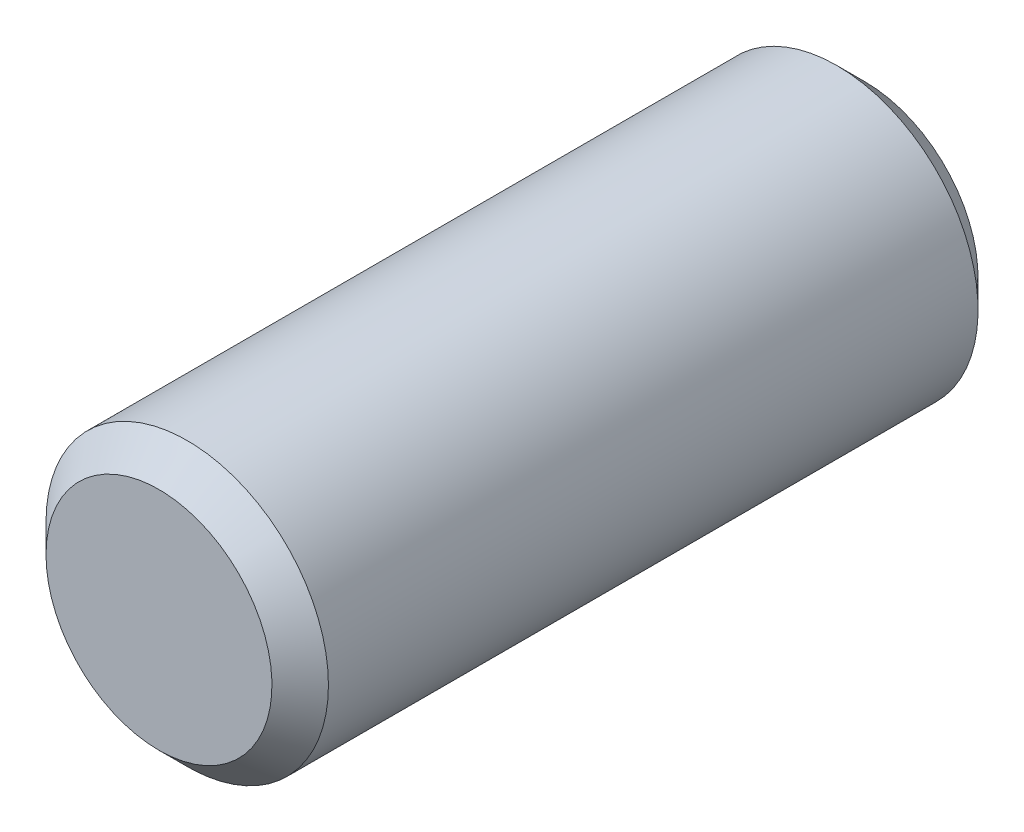
ISO-10303-21;
HEADER;
FILE_DESCRIPTION(('STEP AP214'),'2;1');
FILE_NAME('part.step','',(''),(''),'','','');
FILE_SCHEMA(('AUTOMOTIVE_DESIGN { 1 0 10303 214 1 1 1 1 }'));
ENDSEC;
DATA;
#1=APPLICATION_CONTEXT('core data for automotive mechanical design processes');
#2=APPLICATION_PROTOCOL_DEFINITION('international standard','automotive_design',2000,#1);
#3=PRODUCT_CONTEXT('',#1,'mechanical');
#4=PRODUCT('Part','Part','',(#3));
#5=PRODUCT_RELATED_PRODUCT_CATEGORY('part','',(#4));
#6=PRODUCT_DEFINITION_FORMATION('','',#4);
#7=PRODUCT_DEFINITION_CONTEXT('part definition',#1,'design');
#8=PRODUCT_DEFINITION('design','',#6,#7);
#9=PRODUCT_DEFINITION_SHAPE('','',#8);
#10=(LENGTH_UNIT() NAMED_UNIT(*) SI_UNIT(.MILLI.,.METRE.));
#11=(NAMED_UNIT(*) PLANE_ANGLE_UNIT() SI_UNIT($,.RADIAN.));
#12=(NAMED_UNIT(*) SI_UNIT($,.STERADIAN.) SOLID_ANGLE_UNIT());
#13=UNCERTAINTY_MEASURE_WITH_UNIT(LENGTH_MEASURE(1.E-05),#10,'distance_accuracy_value','');
#14=(GEOMETRIC_REPRESENTATION_CONTEXT(3) GLOBAL_UNCERTAINTY_ASSIGNED_CONTEXT((#13)) GLOBAL_UNIT_ASSIGNED_CONTEXT((#10,
#11,#12)) REPRESENTATION_CONTEXT('',''));
#15=CARTESIAN_POINT('',(0.,0.,0.));
#16=DIRECTION('',(0.,0.,1.));
#17=DIRECTION('',(1.,0.,0.));
#18=AXIS2_PLACEMENT_3D('',#15,#16,#17);
#19=CARTESIAN_POINT('',(0.,0.249999999999996,1.24999999999999));
#20=DIRECTION('',(0.,0.,1.));
#21=DIRECTION('',(0.,-1.,0.));
#22=AXIS2_PLACEMENT_3D('',#19,#20,#21);
#23=PLANE('',#22);
#24=CARTESIAN_POINT('',(0.,-0.250000000000004,1.24999999999999));
#25=DIRECTION('',(0.,0.,1.));
#26=DIRECTION('',(0.,-1.,0.));
#27=AXIS2_PLACEMENT_3D('',#24,#25,#26);
#28=CIRCLE('',#27,0.399999999999999);
#29=CARTESIAN_POINT('',(0.,-0.650000000000003,1.24999999999999));
#30=VERTEX_POINT('',#29);
#31=EDGE_CURVE('E10',#30,#30,#28,.T.);
#32=ORIENTED_EDGE('',*,*,#31,.T.);
#33=EDGE_LOOP('',(#32));
#34=FACE_BOUND('',#33,.T.);
#35=ADVANCED_FACE('F30',(#34),#23,.T.);
#36=CARTESIAN_POINT('',(0.,-0.250000000000003,-1.25000000000002));
#37=DIRECTION('',(0.,0.,-1.));
#38=DIRECTION('',(0.,1.,0.));
#39=AXIS2_PLACEMENT_3D('',#36,#37,#38);
#40=CYLINDRICAL_SURFACE('',#39,0.5);
#41=CARTESIAN_POINT('',(0.,-0.250000000000003,-1.15000000000002));
#42=DIRECTION('',(0.,0.,-1.));
#43=DIRECTION('',(-1.,0.,0.));
#44=AXIS2_PLACEMENT_3D('',#41,#42,#43);
#45=CIRCLE('',#44,0.5);
#46=CARTESIAN_POINT('',(-0.5,-0.250000000000003,-1.15000000000002));
#47=VERTEX_POINT('',#46);
#48=EDGE_CURVE('E37',#47,#47,#45,.F.);
#49=ORIENTED_EDGE('',*,*,#48,.T.);
#50=EDGE_LOOP('',(#49));
#51=FACE_BOUND('',#50,.T.);
#52=CARTESIAN_POINT('',(0.,-0.250000000000004,1.14999999999999));
#53=DIRECTION('',(0.,0.,1.));
#54=DIRECTION('',(1.,0.,0.));
#55=AXIS2_PLACEMENT_3D('',#52,#53,#54);
#56=CIRCLE('',#55,0.5);
#57=CARTESIAN_POINT('',(0.5,-0.250000000000004,1.14999999999999));
#58=VERTEX_POINT('',#57);
#59=EDGE_CURVE('E41',#58,#58,#56,.F.);
#60=ORIENTED_EDGE('',*,*,#59,.T.);
#61=EDGE_LOOP('',(#60));
#62=FACE_BOUND('',#61,.T.);
#63=ADVANCED_FACE('F61',(#51,#62),#40,.T.);
#64=CARTESIAN_POINT('',(0.,0.249999999999997,-1.25000000000002));
#65=DIRECTION('',(0.,0.,-1.));
#66=DIRECTION('',(0.,1.,0.));
#67=AXIS2_PLACEMENT_3D('',#64,#65,#66);
#68=PLANE('',#67);
#69=CARTESIAN_POINT('',(0.,-0.250000000000003,-1.25000000000002));
#70=DIRECTION('',(0.,0.,-1.));
#71=DIRECTION('',(0.,1.,0.));
#72=AXIS2_PLACEMENT_3D('',#69,#70,#71);
#73=CIRCLE('',#72,0.4);
#74=CARTESIAN_POINT('',(0.,0.149999999999997,-1.25000000000002));
#75=VERTEX_POINT('',#74);
#76=EDGE_CURVE('E45',#75,#75,#73,.T.);
#77=ORIENTED_EDGE('',*,*,#76,.T.);
#78=EDGE_LOOP('',(#77));
#79=FACE_BOUND('',#78,.T.);
#80=ADVANCED_FACE('F51',(#79),#68,.T.);
#81=CARTESIAN_POINT('',(0.,-0.250000000000003,-1.25000000000002));
#82=DIRECTION('',(0.,0.,1.));
#83=DIRECTION('',(1.,0.,0.));
#84=AXIS2_PLACEMENT_3D('',#81,#82,#83);
#85=CONICAL_SURFACE('',#84,0.4,0.78539816339745);
#86=ORIENTED_EDGE('',*,*,#48,.F.);
#87=EDGE_LOOP('',(#86));
#88=FACE_BOUND('',#87,.T.);
#89=ORIENTED_EDGE('',*,*,#76,.F.);
#90=EDGE_LOOP('',(#89));
#91=FACE_BOUND('',#90,.T.);
#92=ADVANCED_FACE('F53',(#88,#91),#85,.T.);
#93=CARTESIAN_POINT('',(0.,-0.250000000000004,1.14999999999999));
#94=DIRECTION('',(0.,0.,-1.));
#95=DIRECTION('',(-1.,0.,0.));
#96=AXIS2_PLACEMENT_3D('',#93,#94,#95);
#97=CONICAL_SURFACE('',#96,0.5,0.785398163397452);
#98=ORIENTED_EDGE('',*,*,#31,.F.);
#99=EDGE_LOOP('',(#98));
#100=FACE_BOUND('',#99,.T.);
#101=ORIENTED_EDGE('',*,*,#59,.F.);
#102=EDGE_LOOP('',(#101));
#103=FACE_BOUND('',#102,.T.);
#104=ADVANCED_FACE('F32',(#100,#103),#97,.T.);
#105=CLOSED_SHELL('',(#35,#63,#80,#92,#104));
#106=MANIFOLD_SOLID_BREP('B2',#105);
#107=ADVANCED_BREP_SHAPE_REPRESENTATION('',(#18,#106),#14);
#108=SHAPE_DEFINITION_REPRESENTATION(#9,#107);
ENDSEC;
END-ISO-10303-21;
